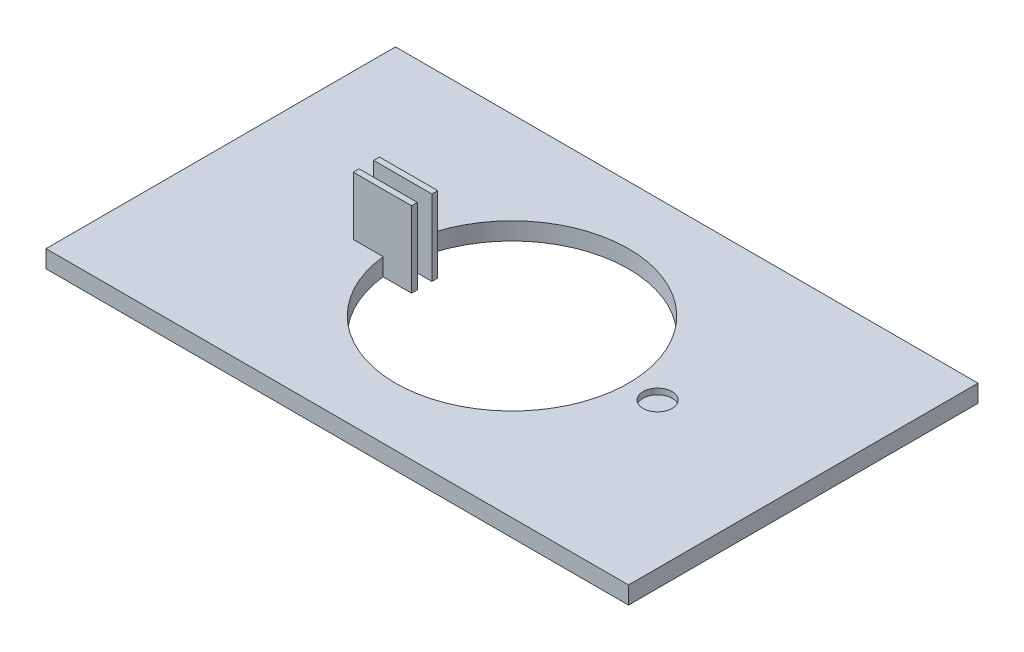
ISO-10303-21;
HEADER;
FILE_DESCRIPTION(('STEP AP214'),'2;1');
FILE_NAME('part.step','',(''),(''),'','','');
FILE_SCHEMA(('AUTOMOTIVE_DESIGN { 1 0 10303 214 1 1 1 1 }'));
ENDSEC;
DATA;
#1=APPLICATION_CONTEXT('core data for automotive mechanical design processes');
#2=APPLICATION_PROTOCOL_DEFINITION('international standard','automotive_design',2000,#1);
#3=PRODUCT_CONTEXT('',#1,'mechanical');
#4=PRODUCT('Part','Part','',(#3));
#5=PRODUCT_RELATED_PRODUCT_CATEGORY('part','',(#4));
#6=PRODUCT_DEFINITION_FORMATION('','',#4);
#7=PRODUCT_DEFINITION_CONTEXT('part definition',#1,'design');
#8=PRODUCT_DEFINITION('design','',#6,#7);
#9=PRODUCT_DEFINITION_SHAPE('','',#8);
#10=(LENGTH_UNIT() NAMED_UNIT(*) SI_UNIT(.MILLI.,.METRE.));
#11=(NAMED_UNIT(*) PLANE_ANGLE_UNIT() SI_UNIT($,.RADIAN.));
#12=(NAMED_UNIT(*) SI_UNIT($,.STERADIAN.) SOLID_ANGLE_UNIT());
#13=UNCERTAINTY_MEASURE_WITH_UNIT(LENGTH_MEASURE(1.E-05),#10,'distance_accuracy_value','');
#14=(GEOMETRIC_REPRESENTATION_CONTEXT(3) GLOBAL_UNCERTAINTY_ASSIGNED_CONTEXT((#13)) GLOBAL_UNIT_ASSIGNED_CONTEXT((#10,
#11,#12)) REPRESENTATION_CONTEXT('',''));
#15=CARTESIAN_POINT('',(0.,0.,0.));
#16=DIRECTION('',(0.,0.,1.));
#17=DIRECTION('',(1.,0.,0.));
#18=AXIS2_PLACEMENT_3D('',#15,#16,#17);
#19=CARTESIAN_POINT('',(0.,3.,0.));
#20=DIRECTION('',(0.,-1.,0.));
#21=DIRECTION('',(0.,0.,-1.));
#22=AXIS2_PLACEMENT_3D('',#19,#20,#21);
#23=CYLINDRICAL_SURFACE('',#22,20.);
#24=DIRECTION('',(0.,-1.,0.));
#25=VECTOR('',#24,1.);
#26=CARTESIAN_POINT('',(-19.9608992783391,3.,1.25));
#27=LINE('',#26,#25);
#28=CARTESIAN_POINT('',(-19.9608992783391,0.,1.25));
#29=VERTEX_POINT('',#28);
#30=CARTESIAN_POINT('',(-19.9608992783391,3.,1.25));
#31=VERTEX_POINT('',#30);
#32=EDGE_CURVE('E11',#29,#31,#27,.F.);
#33=ORIENTED_EDGE('',*,*,#32,.F.);
#34=CARTESIAN_POINT('',(0.,0.,0.));
#35=DIRECTION('',(0.,1.,0.));
#36=DIRECTION('',(0.,0.,1.));
#37=AXIS2_PLACEMENT_3D('',#34,#35,#36);
#38=CIRCLE('',#37,20.);
#39=CARTESIAN_POINT('',(-19.9608992783391,0.,-1.25));
#40=VERTEX_POINT('',#39);
#41=EDGE_CURVE('E154',#40,#29,#38,.T.);
#42=ORIENTED_EDGE('',*,*,#41,.F.);
#43=DIRECTION('',(0.,-1.,0.));
#44=VECTOR('',#43,1.);
#45=CARTESIAN_POINT('',(-19.9608992783391,3.,-1.25));
#46=LINE('',#45,#44);
#47=CARTESIAN_POINT('',(-19.9608992783391,3.,-1.25));
#48=VERTEX_POINT('',#47);
#49=EDGE_CURVE('E261',#48,#40,#46,.T.);
#50=ORIENTED_EDGE('',*,*,#49,.F.);
#51=CARTESIAN_POINT('',(0.,3.,0.));
#52=DIRECTION('',(0.,1.,0.));
#53=DIRECTION('',(0.,0.,1.));
#54=AXIS2_PLACEMENT_3D('',#51,#52,#53);
#55=CIRCLE('',#54,20.);
#56=EDGE_CURVE('E226',#48,#31,#55,.T.);
#57=ORIENTED_EDGE('',*,*,#56,.T.);
#58=EDGE_LOOP('',(#33,#42,#50,#57));
#59=FACE_BOUND('',#58,.T.);
#60=ADVANCED_FACE('F39',(#59),#23,.F.);
#61=CARTESIAN_POINT('',(0.,3.,0.));
#62=DIRECTION('',(0.,1.,0.));
#63=DIRECTION('',(0.,0.,1.));
#64=AXIS2_PLACEMENT_3D('',#61,#62,#63);
#65=PLANE('',#64);
#66=CARTESIAN_POINT('',(25.,3.,0.));
#67=DIRECTION('',(0.,1.,0.));
#68=DIRECTION('',(0.,0.,1.));
#69=AXIS2_PLACEMENT_3D('',#66,#67,#68);
#70=CIRCLE('',#69,2.5);
#71=CARTESIAN_POINT('',(25.,3.,2.5));
#72=VERTEX_POINT('',#71);
#73=EDGE_CURVE('E309',#72,#72,#70,.T.);
#74=ORIENTED_EDGE('',*,*,#73,.F.);
#75=EDGE_LOOP('',(#74));
#76=FACE_BOUND('',#75,.T.);
#77=DIRECTION('',(-1.,0.,0.));
#78=VECTOR('',#77,1.);
#79=CARTESIAN_POINT('',(0.,3.,1.25));
#80=LINE('',#79,#78);
#81=CARTESIAN_POINT('',(-25.,3.,1.25));
#82=VERTEX_POINT('',#81);
#83=EDGE_CURVE('E190',#31,#82,#80,.T.);
#84=ORIENTED_EDGE('',*,*,#83,.F.);
#85=ORIENTED_EDGE('',*,*,#56,.F.);
#86=DIRECTION('',(1.,0.,0.));
#87=VECTOR('',#86,1.);
#88=CARTESIAN_POINT('',(0.,3.,-1.25));
#89=LINE('',#88,#87);
#90=CARTESIAN_POINT('',(-25.,3.,-1.25));
#91=VERTEX_POINT('',#90);
#92=EDGE_CURVE('E219',#91,#48,#89,.T.);
#93=ORIENTED_EDGE('',*,*,#92,.F.);
#94=DIRECTION('',(0.,0.,1.));
#95=VECTOR('',#94,1.);
#96=CARTESIAN_POINT('',(-25.,3.,0.));
#97=LINE('',#96,#95);
#98=CARTESIAN_POINT('',(-25.,3.,-2.25));
#99=VERTEX_POINT('',#98);
#100=EDGE_CURVE('E223',#99,#91,#97,.T.);
#101=ORIENTED_EDGE('',*,*,#100,.F.);
#102=DIRECTION('',(-1.,0.,0.));
#103=VECTOR('',#102,1.);
#104=CARTESIAN_POINT('',(0.,3.,-2.25));
#105=LINE('',#104,#103);
#106=CARTESIAN_POINT('',(-19.8730344940072,3.,-2.25));
#107=VERTEX_POINT('',#106);
#108=EDGE_CURVE('E221',#107,#99,#105,.T.);
#109=ORIENTED_EDGE('',*,*,#108,.F.);
#110=CARTESIAN_POINT('',(-19.8730344940072,3.,2.25));
#111=VERTEX_POINT('',#110);
#112=EDGE_CURVE('E230',#111,#107,#55,.T.);
#113=ORIENTED_EDGE('',*,*,#112,.F.);
#114=DIRECTION('',(1.,0.,0.));
#115=VECTOR('',#114,1.);
#116=CARTESIAN_POINT('',(0.,3.,2.25));
#117=LINE('',#116,#115);
#118=CARTESIAN_POINT('',(-25.,3.,2.25));
#119=VERTEX_POINT('',#118);
#120=EDGE_CURVE('E188',#119,#111,#117,.T.);
#121=ORIENTED_EDGE('',*,*,#120,.F.);
#122=DIRECTION('',(0.,0.,1.));
#123=VECTOR('',#122,1.);
#124=CARTESIAN_POINT('',(-25.,3.,0.));
#125=LINE('',#124,#123);
#126=EDGE_CURVE('E192',#82,#119,#125,.T.);
#127=ORIENTED_EDGE('',*,*,#126,.F.);
#128=EDGE_LOOP('',(#84,#85,#93,#101,#109,#113,#121,#127));
#129=FACE_BOUND('',#128,.T.);
#130=DIRECTION('',(0.,0.,-1.));
#131=VECTOR('',#130,1.);
#132=CARTESIAN_POINT('',(50.,3.,-30.));
#133=LINE('',#132,#131);
#134=CARTESIAN_POINT('',(50.,3.,30.));
#135=VERTEX_POINT('',#134);
#136=CARTESIAN_POINT('',(50.,3.,-30.));
#137=VERTEX_POINT('',#136);
#138=EDGE_CURVE('E232',#135,#137,#133,.T.);
#139=ORIENTED_EDGE('',*,*,#138,.T.);
#140=DIRECTION('',(-1.,0.,0.));
#141=VECTOR('',#140,1.);
#142=CARTESIAN_POINT('',(-50.,3.,-30.));
#143=LINE('',#142,#141);
#144=CARTESIAN_POINT('',(-50.,3.,-30.));
#145=VERTEX_POINT('',#144);
#146=EDGE_CURVE('E235',#137,#145,#143,.T.);
#147=ORIENTED_EDGE('',*,*,#146,.T.);
#148=DIRECTION('',(0.,0.,1.));
#149=VECTOR('',#148,1.);
#150=CARTESIAN_POINT('',(-50.,3.,-30.));
#151=LINE('',#150,#149);
#152=CARTESIAN_POINT('',(-50.,3.,30.));
#153=VERTEX_POINT('',#152);
#154=EDGE_CURVE('E238',#145,#153,#151,.T.);
#155=ORIENTED_EDGE('',*,*,#154,.T.);
#156=DIRECTION('',(1.,0.,0.));
#157=VECTOR('',#156,1.);
#158=CARTESIAN_POINT('',(-50.,3.,30.));
#159=LINE('',#158,#157);
#160=EDGE_CURVE('E240',#153,#135,#159,.T.);
#161=ORIENTED_EDGE('',*,*,#160,.T.);
#162=EDGE_LOOP('',(#139,#147,#155,#161));
#163=FACE_BOUND('',#162,.T.);
#164=ADVANCED_FACE('F301',(#76,#129,#163),#65,.T.);
#165=CARTESIAN_POINT('',(0.,0.,0.));
#166=DIRECTION('',(0.,1.,0.));
#167=DIRECTION('',(0.,0.,1.));
#168=AXIS2_PLACEMENT_3D('',#165,#166,#167);
#169=PLANE('',#168);
#170=DIRECTION('',(-1.,0.,0.));
#171=VECTOR('',#170,1.);
#172=CARTESIAN_POINT('',(-25.,0.,2.25));
#173=LINE('',#172,#171);
#174=CARTESIAN_POINT('',(-15.,0.,2.25));
#175=VERTEX_POINT('',#174);
#176=CARTESIAN_POINT('',(-19.8730344940072,0.,2.25));
#177=VERTEX_POINT('',#176);
#178=EDGE_CURVE('E54',#175,#177,#173,.T.);
#179=ORIENTED_EDGE('',*,*,#178,.T.);
#180=CARTESIAN_POINT('',(-19.8730344940072,0.,-2.25));
#181=VERTEX_POINT('',#180);
#182=EDGE_CURVE('E225',#177,#181,#38,.T.);
#183=ORIENTED_EDGE('',*,*,#182,.T.);
#184=DIRECTION('',(1.,0.,0.));
#185=VECTOR('',#184,1.);
#186=CARTESIAN_POINT('',(-15.,0.,-2.25));
#187=LINE('',#186,#185);
#188=CARTESIAN_POINT('',(-15.,0.,-2.25));
#189=VERTEX_POINT('',#188);
#190=EDGE_CURVE('E209',#181,#189,#187,.T.);
#191=ORIENTED_EDGE('',*,*,#190,.T.);
#192=DIRECTION('',(0.,0.,1.));
#193=VECTOR('',#192,1.);
#194=CARTESIAN_POINT('',(-15.,0.,-1.25));
#195=LINE('',#194,#193);
#196=CARTESIAN_POINT('',(-15.,0.,-1.25));
#197=VERTEX_POINT('',#196);
#198=EDGE_CURVE('E207',#189,#197,#195,.T.);
#199=ORIENTED_EDGE('',*,*,#198,.T.);
#200=DIRECTION('',(-1.,0.,0.));
#201=VECTOR('',#200,1.);
#202=CARTESIAN_POINT('',(-25.,0.,-1.25));
#203=LINE('',#202,#201);
#204=EDGE_CURVE('E61',#197,#40,#203,.T.);
#205=ORIENTED_EDGE('',*,*,#204,.T.);
#206=ORIENTED_EDGE('',*,*,#41,.T.);
#207=DIRECTION('',(1.,0.,0.));
#208=VECTOR('',#207,1.);
#209=CARTESIAN_POINT('',(-15.,0.,1.25));
#210=LINE('',#209,#208);
#211=CARTESIAN_POINT('',(-15.,0.,1.25));
#212=VERTEX_POINT('',#211);
#213=EDGE_CURVE('E148',#29,#212,#210,.T.);
#214=ORIENTED_EDGE('',*,*,#213,.T.);
#215=DIRECTION('',(0.,0.,1.));
#216=VECTOR('',#215,1.);
#217=CARTESIAN_POINT('',(-15.,0.,2.25));
#218=LINE('',#217,#216);
#219=EDGE_CURVE('E152',#212,#175,#218,.T.);
#220=ORIENTED_EDGE('',*,*,#219,.T.);
#221=EDGE_LOOP('',(#179,#183,#191,#199,#205,#206,#214,#220));
#222=FACE_BOUND('',#221,.T.);
#223=DIRECTION('',(0.,0.,-1.));
#224=VECTOR('',#223,1.);
#225=CARTESIAN_POINT('',(50.,0.,-30.));
#226=LINE('',#225,#224);
#227=CARTESIAN_POINT('',(50.,0.,30.));
#228=VERTEX_POINT('',#227);
#229=CARTESIAN_POINT('',(50.,0.,-30.));
#230=VERTEX_POINT('',#229);
#231=EDGE_CURVE('E229',#228,#230,#226,.T.);
#232=ORIENTED_EDGE('',*,*,#231,.F.);
#233=DIRECTION('',(1.,0.,0.));
#234=VECTOR('',#233,1.);
#235=CARTESIAN_POINT('',(-50.,0.,30.));
#236=LINE('',#235,#234);
#237=CARTESIAN_POINT('',(-50.,0.,30.));
#238=VERTEX_POINT('',#237);
#239=EDGE_CURVE('E236',#238,#228,#236,.T.);
#240=ORIENTED_EDGE('',*,*,#239,.F.);
#241=DIRECTION('',(0.,0.,1.));
#242=VECTOR('',#241,1.);
#243=CARTESIAN_POINT('',(-50.,0.,-30.));
#244=LINE('',#243,#242);
#245=CARTESIAN_POINT('',(-50.,0.,-30.));
#246=VERTEX_POINT('',#245);
#247=EDGE_CURVE('E247',#246,#238,#244,.T.);
#248=ORIENTED_EDGE('',*,*,#247,.F.);
#249=DIRECTION('',(-1.,0.,0.));
#250=VECTOR('',#249,1.);
#251=CARTESIAN_POINT('',(-50.,0.,-30.));
#252=LINE('',#251,#250);
#253=EDGE_CURVE('E245',#230,#246,#252,.T.);
#254=ORIENTED_EDGE('',*,*,#253,.F.);
#255=EDGE_LOOP('',(#232,#240,#248,#254));
#256=FACE_BOUND('',#255,.T.);
#257=ADVANCED_FACE('F150',(#222,#256),#169,.F.);
#258=CARTESIAN_POINT('',(50.,3.,-30.));
#259=DIRECTION('',(-1.,0.,0.));
#260=DIRECTION('',(0.,0.,1.));
#261=AXIS2_PLACEMENT_3D('',#258,#259,#260);
#262=PLANE('',#261);
#263=ORIENTED_EDGE('',*,*,#231,.T.);
#264=DIRECTION('',(0.,-1.,0.));
#265=VECTOR('',#264,1.);
#266=CARTESIAN_POINT('',(50.,3.,-30.));
#267=LINE('',#266,#265);
#268=EDGE_CURVE('E258',#137,#230,#267,.T.);
#269=ORIENTED_EDGE('',*,*,#268,.F.);
#270=ORIENTED_EDGE('',*,*,#138,.F.);
#271=DIRECTION('',(0.,-1.,0.));
#272=VECTOR('',#271,1.);
#273=CARTESIAN_POINT('',(50.,3.,30.));
#274=LINE('',#273,#272);
#275=EDGE_CURVE('E242',#135,#228,#274,.T.);
#276=ORIENTED_EDGE('',*,*,#275,.T.);
#277=EDGE_LOOP('',(#263,#269,#270,#276));
#278=FACE_BOUND('',#277,.T.);
#279=ADVANCED_FACE('F41',(#278),#262,.F.);
#280=CARTESIAN_POINT('',(-50.,3.,-30.));
#281=DIRECTION('',(0.,0.,1.));
#282=DIRECTION('',(1.,0.,0.));
#283=AXIS2_PLACEMENT_3D('',#280,#281,#282);
#284=PLANE('',#283);
#285=ORIENTED_EDGE('',*,*,#253,.T.);
#286=DIRECTION('',(0.,-1.,0.));
#287=VECTOR('',#286,1.);
#288=CARTESIAN_POINT('',(-50.,3.,-30.));
#289=LINE('',#288,#287);
#290=EDGE_CURVE('E255',#145,#246,#289,.T.);
#291=ORIENTED_EDGE('',*,*,#290,.F.);
#292=ORIENTED_EDGE('',*,*,#146,.F.);
#293=ORIENTED_EDGE('',*,*,#268,.T.);
#294=EDGE_LOOP('',(#285,#291,#292,#293));
#295=FACE_BOUND('',#294,.T.);
#296=ADVANCED_FACE('F341',(#295),#284,.F.);
#297=CARTESIAN_POINT('',(-50.,3.,-30.));
#298=DIRECTION('',(1.,0.,0.));
#299=DIRECTION('',(0.,0.,-1.));
#300=AXIS2_PLACEMENT_3D('',#297,#298,#299);
#301=PLANE('',#300);
#302=ORIENTED_EDGE('',*,*,#247,.T.);
#303=DIRECTION('',(0.,-1.,0.));
#304=VECTOR('',#303,1.);
#305=CARTESIAN_POINT('',(-50.,3.,30.));
#306=LINE('',#305,#304);
#307=EDGE_CURVE('E252',#153,#238,#306,.T.);
#308=ORIENTED_EDGE('',*,*,#307,.F.);
#309=ORIENTED_EDGE('',*,*,#154,.F.);
#310=ORIENTED_EDGE('',*,*,#290,.T.);
#311=EDGE_LOOP('',(#302,#308,#309,#310));
#312=FACE_BOUND('',#311,.T.);
#313=ADVANCED_FACE('F338',(#312),#301,.F.);
#314=CARTESIAN_POINT('',(-50.,3.,30.));
#315=DIRECTION('',(0.,0.,-1.));
#316=DIRECTION('',(-1.,0.,0.));
#317=AXIS2_PLACEMENT_3D('',#314,#315,#316);
#318=PLANE('',#317);
#319=ORIENTED_EDGE('',*,*,#239,.T.);
#320=ORIENTED_EDGE('',*,*,#275,.F.);
#321=ORIENTED_EDGE('',*,*,#160,.F.);
#322=ORIENTED_EDGE('',*,*,#307,.T.);
#323=EDGE_LOOP('',(#319,#320,#321,#322));
#324=FACE_BOUND('',#323,.T.);
#325=ADVANCED_FACE('F335',(#324),#318,.F.);
#326=DIRECTION('',(0.,-1.,0.));
#327=VECTOR('',#326,1.);
#328=CARTESIAN_POINT('',(-19.8730344940072,3.,2.25));
#329=LINE('',#328,#327);
#330=EDGE_CURVE('E47',#111,#177,#329,.T.);
#331=ORIENTED_EDGE('',*,*,#330,.F.);
#332=ORIENTED_EDGE('',*,*,#112,.T.);
#333=DIRECTION('',(0.,-1.,0.));
#334=VECTOR('',#333,1.);
#335=CARTESIAN_POINT('',(-19.8730344940072,3.,-2.25));
#336=LINE('',#335,#334);
#337=EDGE_CURVE('E263',#181,#107,#336,.F.);
#338=ORIENTED_EDGE('',*,*,#337,.F.);
#339=ORIENTED_EDGE('',*,*,#182,.F.);
#340=EDGE_LOOP('',(#331,#332,#338,#339));
#341=FACE_BOUND('',#340,.T.);
#342=ADVANCED_FACE('F274',(#341),#23,.F.);
#343=CARTESIAN_POINT('',(-25.,-10.0498756211209,-2.25));
#344=DIRECTION('',(-1.,0.,0.));
#345=DIRECTION('',(0.,0.,1.));
#346=AXIS2_PLACEMENT_3D('',#343,#344,#345);
#347=PLANE('',#346);
#348=DIRECTION('',(0.,1.,0.));
#349=VECTOR('',#348,1.);
#350=CARTESIAN_POINT('',(-25.,-10.0498756211209,-2.25));
#351=LINE('',#350,#349);
#352=CARTESIAN_POINT('',(-25.,13.,-2.25));
#353=VERTEX_POINT('',#352);
#354=EDGE_CURVE('E210',#99,#353,#351,.T.);
#355=ORIENTED_EDGE('',*,*,#354,.F.);
#356=ORIENTED_EDGE('',*,*,#100,.T.);
#357=DIRECTION('',(0.,1.,0.));
#358=VECTOR('',#357,1.);
#359=CARTESIAN_POINT('',(-25.,-10.0498756211209,-1.25));
#360=LINE('',#359,#358);
#361=CARTESIAN_POINT('',(-25.,13.,-1.25));
#362=VERTEX_POINT('',#361);
#363=EDGE_CURVE('E206',#91,#362,#360,.T.);
#364=ORIENTED_EDGE('',*,*,#363,.T.);
#365=DIRECTION('',(0.,0.,1.));
#366=VECTOR('',#365,1.);
#367=CARTESIAN_POINT('',(-25.,13.,-2.25));
#368=LINE('',#367,#366);
#369=EDGE_CURVE('E194',#353,#362,#368,.T.);
#370=ORIENTED_EDGE('',*,*,#369,.F.);
#371=EDGE_LOOP('',(#355,#356,#364,#370));
#372=FACE_BOUND('',#371,.T.);
#373=ADVANCED_FACE('F392',(#372),#347,.T.);
#374=CARTESIAN_POINT('',(-15.,-10.0498756211209,-2.25));
#375=DIRECTION('',(0.,0.,-1.));
#376=DIRECTION('',(-1.,0.,0.));
#377=AXIS2_PLACEMENT_3D('',#374,#375,#376);
#378=PLANE('',#377);
#379=ORIENTED_EDGE('',*,*,#337,.T.);
#380=ORIENTED_EDGE('',*,*,#108,.T.);
#381=ORIENTED_EDGE('',*,*,#354,.T.);
#382=DIRECTION('',(-1.,0.,0.));
#383=VECTOR('',#382,1.);
#384=CARTESIAN_POINT('',(-15.,13.,-2.25));
#385=LINE('',#384,#383);
#386=CARTESIAN_POINT('',(-15.,13.,-2.25));
#387=VERTEX_POINT('',#386);
#388=EDGE_CURVE('E203',#387,#353,#385,.T.);
#389=ORIENTED_EDGE('',*,*,#388,.F.);
#390=DIRECTION('',(0.,1.,0.));
#391=VECTOR('',#390,1.);
#392=CARTESIAN_POINT('',(-15.,-10.0498756211209,-2.25));
#393=LINE('',#392,#391);
#394=EDGE_CURVE('E213',#189,#387,#393,.T.);
#395=ORIENTED_EDGE('',*,*,#394,.F.);
#396=ORIENTED_EDGE('',*,*,#190,.F.);
#397=EDGE_LOOP('',(#379,#380,#381,#389,#395,#396));
#398=FACE_BOUND('',#397,.T.);
#399=ADVANCED_FACE('F279',(#398),#378,.T.);
#400=CARTESIAN_POINT('',(-15.,-10.0498756211209,-1.25));
#401=DIRECTION('',(1.,0.,0.));
#402=DIRECTION('',(0.,0.,-1.));
#403=AXIS2_PLACEMENT_3D('',#400,#401,#402);
#404=PLANE('',#403);
#405=ORIENTED_EDGE('',*,*,#198,.F.);
#406=ORIENTED_EDGE('',*,*,#394,.T.);
#407=DIRECTION('',(0.,0.,-1.));
#408=VECTOR('',#407,1.);
#409=CARTESIAN_POINT('',(-15.,13.,-1.25));
#410=LINE('',#409,#408);
#411=CARTESIAN_POINT('',(-15.,13.,-1.25));
#412=VERTEX_POINT('',#411);
#413=EDGE_CURVE('E200',#412,#387,#410,.T.);
#414=ORIENTED_EDGE('',*,*,#413,.F.);
#415=DIRECTION('',(0.,1.,0.));
#416=VECTOR('',#415,1.);
#417=CARTESIAN_POINT('',(-15.,-10.0498756211209,-1.25));
#418=LINE('',#417,#416);
#419=EDGE_CURVE('E215',#197,#412,#418,.T.);
#420=ORIENTED_EDGE('',*,*,#419,.F.);
#421=EDGE_LOOP('',(#405,#406,#414,#420));
#422=FACE_BOUND('',#421,.T.);
#423=ADVANCED_FACE('F284',(#422),#404,.T.);
#424=CARTESIAN_POINT('',(-25.,-10.0498756211209,-1.25));
#425=DIRECTION('',(0.,0.,1.));
#426=DIRECTION('',(1.,0.,0.));
#427=AXIS2_PLACEMENT_3D('',#424,#425,#426);
#428=PLANE('',#427);
#429=ORIENTED_EDGE('',*,*,#363,.F.);
#430=ORIENTED_EDGE('',*,*,#92,.T.);
#431=ORIENTED_EDGE('',*,*,#49,.T.);
#432=ORIENTED_EDGE('',*,*,#204,.F.);
#433=ORIENTED_EDGE('',*,*,#419,.T.);
#434=DIRECTION('',(1.,0.,0.));
#435=VECTOR('',#434,1.);
#436=CARTESIAN_POINT('',(-25.,13.,-1.25));
#437=LINE('',#436,#435);
#438=EDGE_CURVE('E197',#362,#412,#437,.T.);
#439=ORIENTED_EDGE('',*,*,#438,.F.);
#440=EDGE_LOOP('',(#429,#430,#431,#432,#433,#439));
#441=FACE_BOUND('',#440,.T.);
#442=ADVANCED_FACE('F292',(#441),#428,.T.);
#443=CARTESIAN_POINT('',(0.,13.,0.));
#444=DIRECTION('',(0.,1.,0.));
#445=DIRECTION('',(0.,0.,1.));
#446=AXIS2_PLACEMENT_3D('',#443,#444,#445);
#447=PLANE('',#446);
#448=ORIENTED_EDGE('',*,*,#369,.T.);
#449=ORIENTED_EDGE('',*,*,#438,.T.);
#450=ORIENTED_EDGE('',*,*,#413,.T.);
#451=ORIENTED_EDGE('',*,*,#388,.T.);
#452=EDGE_LOOP('',(#448,#449,#450,#451));
#453=FACE_BOUND('',#452,.T.);
#454=ADVANCED_FACE('F287',(#453),#447,.T.);
#455=CARTESIAN_POINT('',(-15.,-10.0498756211209,1.25));
#456=DIRECTION('',(0.,0.,-1.));
#457=DIRECTION('',(-1.,0.,0.));
#458=AXIS2_PLACEMENT_3D('',#455,#456,#457);
#459=PLANE('',#458);
#460=ORIENTED_EDGE('',*,*,#32,.T.);
#461=ORIENTED_EDGE('',*,*,#83,.T.);
#462=DIRECTION('',(0.,1.,0.));
#463=VECTOR('',#462,1.);
#464=CARTESIAN_POINT('',(-25.,-10.0498756211209,1.25));
#465=LINE('',#464,#463);
#466=CARTESIAN_POINT('',(-25.,13.,1.25));
#467=VERTEX_POINT('',#466);
#468=EDGE_CURVE('E181',#82,#467,#465,.T.);
#469=ORIENTED_EDGE('',*,*,#468,.T.);
#470=DIRECTION('',(-1.,0.,0.));
#471=VECTOR('',#470,1.);
#472=CARTESIAN_POINT('',(-15.,13.,1.25));
#473=LINE('',#472,#471);
#474=CARTESIAN_POINT('',(-15.,13.,1.25));
#475=VERTEX_POINT('',#474);
#476=EDGE_CURVE('E171',#475,#467,#473,.T.);
#477=ORIENTED_EDGE('',*,*,#476,.F.);
#478=DIRECTION('',(0.,1.,0.));
#479=VECTOR('',#478,1.);
#480=CARTESIAN_POINT('',(-15.,-10.0498756211209,1.25));
#481=LINE('',#480,#479);
#482=EDGE_CURVE('E164',#212,#475,#481,.T.);
#483=ORIENTED_EDGE('',*,*,#482,.F.);
#484=ORIENTED_EDGE('',*,*,#213,.F.);
#485=EDGE_LOOP('',(#460,#461,#469,#477,#483,#484));
#486=FACE_BOUND('',#485,.T.);
#487=ADVANCED_FACE('F169',(#486),#459,.T.);
#488=CARTESIAN_POINT('',(-15.,-10.0498756211209,2.25));
#489=DIRECTION('',(1.,0.,0.));
#490=DIRECTION('',(0.,0.,-1.));
#491=AXIS2_PLACEMENT_3D('',#488,#489,#490);
#492=PLANE('',#491);
#493=ORIENTED_EDGE('',*,*,#219,.F.);
#494=ORIENTED_EDGE('',*,*,#482,.T.);
#495=DIRECTION('',(0.,0.,-1.));
#496=VECTOR('',#495,1.);
#497=CARTESIAN_POINT('',(-15.,13.,2.25));
#498=LINE('',#497,#496);
#499=CARTESIAN_POINT('',(-15.,13.,2.25));
#500=VERTEX_POINT('',#499);
#501=EDGE_CURVE('E178',#500,#475,#498,.T.);
#502=ORIENTED_EDGE('',*,*,#501,.F.);
#503=DIRECTION('',(0.,1.,0.));
#504=VECTOR('',#503,1.);
#505=CARTESIAN_POINT('',(-15.,-10.0498756211209,2.25));
#506=LINE('',#505,#504);
#507=EDGE_CURVE('E166',#175,#500,#506,.T.);
#508=ORIENTED_EDGE('',*,*,#507,.F.);
#509=EDGE_LOOP('',(#493,#494,#502,#508));
#510=FACE_BOUND('',#509,.T.);
#511=ADVANCED_FACE('F162',(#510),#492,.T.);
#512=CARTESIAN_POINT('',(-25.,-10.0498756211209,2.25));
#513=DIRECTION('',(0.,0.,1.));
#514=DIRECTION('',(1.,0.,0.));
#515=AXIS2_PLACEMENT_3D('',#512,#513,#514);
#516=PLANE('',#515);
#517=DIRECTION('',(0.,1.,0.));
#518=VECTOR('',#517,1.);
#519=CARTESIAN_POINT('',(-25.,-10.0498756211209,2.25));
#520=LINE('',#519,#518);
#521=CARTESIAN_POINT('',(-25.,13.,2.25));
#522=VERTEX_POINT('',#521);
#523=EDGE_CURVE('E173',#119,#522,#520,.T.);
#524=ORIENTED_EDGE('',*,*,#523,.F.);
#525=ORIENTED_EDGE('',*,*,#120,.T.);
#526=ORIENTED_EDGE('',*,*,#330,.T.);
#527=ORIENTED_EDGE('',*,*,#178,.F.);
#528=ORIENTED_EDGE('',*,*,#507,.T.);
#529=DIRECTION('',(1.,0.,0.));
#530=VECTOR('',#529,1.);
#531=CARTESIAN_POINT('',(-25.,13.,2.25));
#532=LINE('',#531,#530);
#533=EDGE_CURVE('E180',#522,#500,#532,.T.);
#534=ORIENTED_EDGE('',*,*,#533,.F.);
#535=EDGE_LOOP('',(#524,#525,#526,#527,#528,#534));
#536=FACE_BOUND('',#535,.T.);
#537=ADVANCED_FACE('F269',(#536),#516,.T.);
#538=CARTESIAN_POINT('',(-25.,-10.0498756211209,1.25));
#539=DIRECTION('',(-1.,0.,0.));
#540=DIRECTION('',(0.,0.,1.));
#541=AXIS2_PLACEMENT_3D('',#538,#539,#540);
#542=PLANE('',#541);
#543=ORIENTED_EDGE('',*,*,#468,.F.);
#544=ORIENTED_EDGE('',*,*,#126,.T.);
#545=ORIENTED_EDGE('',*,*,#523,.T.);
#546=DIRECTION('',(0.,0.,1.));
#547=VECTOR('',#546,1.);
#548=CARTESIAN_POINT('',(-25.,13.,1.25));
#549=LINE('',#548,#547);
#550=EDGE_CURVE('E184',#467,#522,#549,.T.);
#551=ORIENTED_EDGE('',*,*,#550,.F.);
#552=EDGE_LOOP('',(#543,#544,#545,#551));
#553=FACE_BOUND('',#552,.T.);
#554=ADVANCED_FACE('F304',(#553),#542,.T.);
#555=CARTESIAN_POINT('',(0.,13.,0.));
#556=DIRECTION('',(0.,1.,0.));
#557=DIRECTION('',(0.,0.,1.));
#558=AXIS2_PLACEMENT_3D('',#555,#556,#557);
#559=PLANE('',#558);
#560=ORIENTED_EDGE('',*,*,#476,.T.);
#561=ORIENTED_EDGE('',*,*,#550,.T.);
#562=ORIENTED_EDGE('',*,*,#533,.T.);
#563=ORIENTED_EDGE('',*,*,#501,.T.);
#564=EDGE_LOOP('',(#560,#561,#562,#563));
#565=FACE_BOUND('',#564,.T.);
#566=ADVANCED_FACE('F320',(#565),#559,.T.);
#567=CARTESIAN_POINT('',(25.,2.,0.));
#568=DIRECTION('',(0.,1.,0.));
#569=DIRECTION('',(0.,0.,1.));
#570=AXIS2_PLACEMENT_3D('',#567,#568,#569);
#571=CYLINDRICAL_SURFACE('',#570,2.5);
#572=CARTESIAN_POINT('',(25.,2.,0.));
#573=DIRECTION('',(0.,1.,0.));
#574=DIRECTION('',(0.,0.,1.));
#575=AXIS2_PLACEMENT_3D('',#572,#573,#574);
#576=CIRCLE('',#575,2.5);
#577=CARTESIAN_POINT('',(25.,2.,2.5));
#578=VERTEX_POINT('',#577);
#579=EDGE_CURVE('E158',#578,#578,#576,.T.);
#580=ORIENTED_EDGE('',*,*,#579,.F.);
#581=EDGE_LOOP('',(#580));
#582=FACE_BOUND('',#581,.T.);
#583=ORIENTED_EDGE('',*,*,#73,.T.);
#584=EDGE_LOOP('',(#583));
#585=FACE_BOUND('',#584,.T.);
#586=ADVANCED_FACE('F317',(#582,#585),#571,.F.);
#587=CARTESIAN_POINT('',(25.,2.,0.));
#588=DIRECTION('',(0.,1.,0.));
#589=DIRECTION('',(0.,0.,1.));
#590=AXIS2_PLACEMENT_3D('',#587,#588,#589);
#591=PLANE('',#590);
#592=ORIENTED_EDGE('',*,*,#579,.T.);
#593=EDGE_LOOP('',(#592));
#594=FACE_BOUND('',#593,.T.);
#595=ADVANCED_FACE('F315',(#594),#591,.T.);
#596=CLOSED_SHELL('',(#60,#164,#257,#279,#296,#313,#325,#342,#373,#399,#423,#442,#454,#487,#511,
#537,#554,#566,#586,#595));
#597=MANIFOLD_SOLID_BREP('B2',#596);
#598=ADVANCED_BREP_SHAPE_REPRESENTATION('',(#18,#597),#14);
#599=SHAPE_DEFINITION_REPRESENTATION(#9,#598);
ENDSEC;
END-ISO-10303-21;
